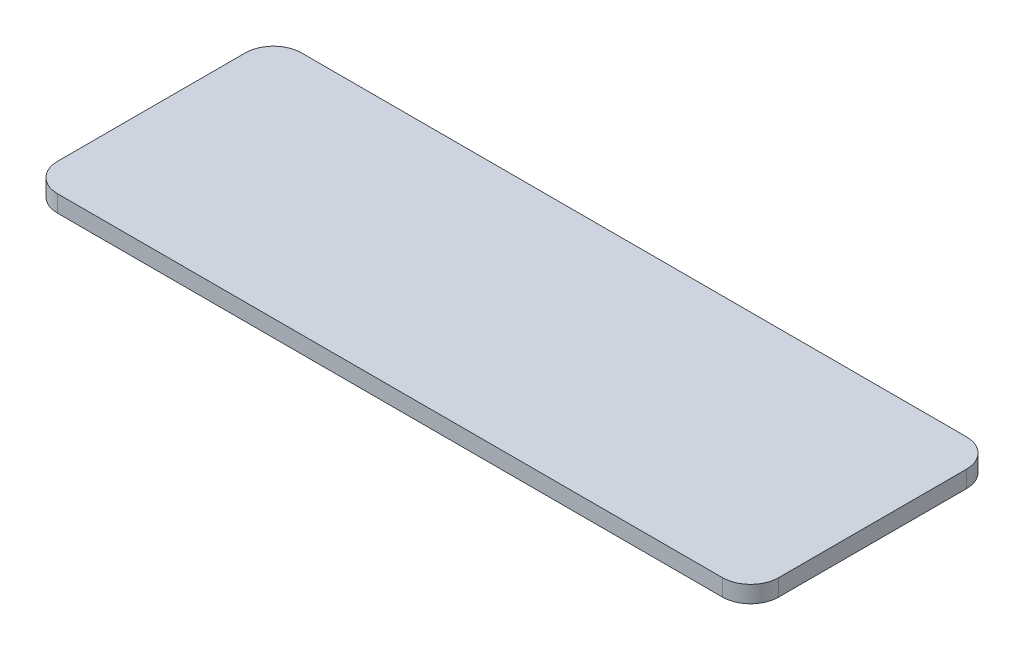
ISO-10303-21;
HEADER;
FILE_DESCRIPTION(('STEP AP214'),'2;1');
FILE_NAME('part.step','',(''),(''),'','','');
FILE_SCHEMA(('AUTOMOTIVE_DESIGN { 1 0 10303 214 1 1 1 1 }'));
ENDSEC;
DATA;
#1=APPLICATION_CONTEXT('core data for automotive mechanical design processes');
#2=APPLICATION_PROTOCOL_DEFINITION('international standard','automotive_design',2000,#1);
#3=PRODUCT_CONTEXT('',#1,'mechanical');
#4=PRODUCT('Part','Part','',(#3));
#5=PRODUCT_RELATED_PRODUCT_CATEGORY('part','',(#4));
#6=PRODUCT_DEFINITION_FORMATION('','',#4);
#7=PRODUCT_DEFINITION_CONTEXT('part definition',#1,'design');
#8=PRODUCT_DEFINITION('design','',#6,#7);
#9=PRODUCT_DEFINITION_SHAPE('','',#8);
#10=(LENGTH_UNIT() NAMED_UNIT(*) SI_UNIT(.MILLI.,.METRE.));
#11=(NAMED_UNIT(*) PLANE_ANGLE_UNIT() SI_UNIT($,.RADIAN.));
#12=(NAMED_UNIT(*) SI_UNIT($,.STERADIAN.) SOLID_ANGLE_UNIT());
#13=UNCERTAINTY_MEASURE_WITH_UNIT(LENGTH_MEASURE(1.E-05),#10,'distance_accuracy_value','');
#14=(GEOMETRIC_REPRESENTATION_CONTEXT(3) GLOBAL_UNCERTAINTY_ASSIGNED_CONTEXT((#13)) GLOBAL_UNIT_ASSIGNED_CONTEXT((#10,
#11,#12)) REPRESENTATION_CONTEXT('',''));
#15=CARTESIAN_POINT('',(0.,0.,0.));
#16=DIRECTION('',(0.,0.,1.));
#17=DIRECTION('',(1.,0.,0.));
#18=AXIS2_PLACEMENT_3D('',#15,#16,#17);
#19=CARTESIAN_POINT('',(35.2483988192163,6.,-35.0361602378579));
#20=DIRECTION('',(-1.,0.,0.));
#21=DIRECTION('',(0.,0.,1.));
#22=AXIS2_PLACEMENT_3D('',#19,#20,#21);
#23=PLANE('',#22);
#24=DIRECTION('',(0.,0.,-1.));
#25=VECTOR('',#24,1.);
#26=CARTESIAN_POINT('',(35.2483988192163,0.,-35.0361602378579));
#27=LINE('',#26,#25);
#28=CARTESIAN_POINT('',(35.2483988192163,0.,-45.0361602378579));
#29=VERTEX_POINT('',#28);
#30=CARTESIAN_POINT('',(35.2483988192163,0.,-111.80001656245));
#31=VERTEX_POINT('',#30);
#32=EDGE_CURVE('E128',#29,#31,#27,.T.);
#33=ORIENTED_EDGE('',*,*,#32,.T.);
#34=DIRECTION('',(0.,-1.,0.));
#35=VECTOR('',#34,1.);
#36=CARTESIAN_POINT('',(35.2483988192163,6.,-111.80001656245));
#37=LINE('',#36,#35);
#38=CARTESIAN_POINT('',(35.2483988192163,6.,-111.80001656245));
#39=VERTEX_POINT('',#38);
#40=EDGE_CURVE('E151',#31,#39,#37,.F.);
#41=ORIENTED_EDGE('',*,*,#40,.T.);
#42=DIRECTION('',(0.,0.,-1.));
#43=VECTOR('',#42,1.);
#44=CARTESIAN_POINT('',(35.2483988192163,6.,-35.0361602378579));
#45=LINE('',#44,#43);
#46=CARTESIAN_POINT('',(35.2483988192163,6.,-45.0361602378579));
#47=VERTEX_POINT('',#46);
#48=EDGE_CURVE('E126',#47,#39,#45,.T.);
#49=ORIENTED_EDGE('',*,*,#48,.F.);
#50=DIRECTION('',(0.,-1.,0.));
#51=VECTOR('',#50,1.);
#52=CARTESIAN_POINT('',(35.2483988192163,6.,-45.0361602378579));
#53=LINE('',#52,#51);
#54=EDGE_CURVE('E148',#47,#29,#53,.T.);
#55=ORIENTED_EDGE('',*,*,#54,.T.);
#56=EDGE_LOOP('',(#33,#41,#49,#55));
#57=FACE_BOUND('',#56,.T.);
#58=ADVANCED_FACE('F33',(#57),#23,.F.);
#59=CARTESIAN_POINT('',(-221.199113930992,6.,-121.80001656245));
#60=DIRECTION('',(0.,0.,1.));
#61=DIRECTION('',(1.,0.,0.));
#62=AXIS2_PLACEMENT_3D('',#59,#60,#61);
#63=PLANE('',#62);
#64=DIRECTION('',(-1.,0.,0.));
#65=VECTOR('',#64,1.);
#66=CARTESIAN_POINT('',(-221.199113930992,0.,-121.80001656245));
#67=LINE('',#66,#65);
#68=CARTESIAN_POINT('',(25.2483988192163,0.,-121.80001656245));
#69=VERTEX_POINT('',#68);
#70=CARTESIAN_POINT('',(-211.199113930992,0.,-121.80001656245));
#71=VERTEX_POINT('',#70);
#72=EDGE_CURVE('E124',#69,#71,#67,.T.);
#73=ORIENTED_EDGE('',*,*,#72,.T.);
#74=DIRECTION('',(0.,-1.,0.));
#75=VECTOR('',#74,1.);
#76=CARTESIAN_POINT('',(-211.199113930992,6.,-121.80001656245));
#77=LINE('',#76,#75);
#78=CARTESIAN_POINT('',(-211.199113930992,6.,-121.80001656245));
#79=VERTEX_POINT('',#78);
#80=EDGE_CURVE('E103',#71,#79,#77,.F.);
#81=ORIENTED_EDGE('',*,*,#80,.T.);
#82=DIRECTION('',(-1.,0.,0.));
#83=VECTOR('',#82,1.);
#84=CARTESIAN_POINT('',(-221.199113930992,6.,-121.80001656245));
#85=LINE('',#84,#83);
#86=CARTESIAN_POINT('',(25.2483988192163,6.,-121.80001656245));
#87=VERTEX_POINT('',#86);
#88=EDGE_CURVE('E167',#87,#79,#85,.T.);
#89=ORIENTED_EDGE('',*,*,#88,.F.);
#90=DIRECTION('',(0.,-1.,0.));
#91=VECTOR('',#90,1.);
#92=CARTESIAN_POINT('',(25.2483988192163,6.,-121.80001656245));
#93=LINE('',#92,#91);
#94=EDGE_CURVE('E108',#87,#69,#93,.T.);
#95=ORIENTED_EDGE('',*,*,#94,.T.);
#96=EDGE_LOOP('',(#73,#81,#89,#95));
#97=FACE_BOUND('',#96,.T.);
#98=ADVANCED_FACE('F184',(#97),#63,.F.);
#99=CARTESIAN_POINT('',(-221.199113930992,6.,-35.0361602378579));
#100=DIRECTION('',(1.,0.,0.));
#101=DIRECTION('',(0.,0.,-1.));
#102=AXIS2_PLACEMENT_3D('',#99,#100,#101);
#103=PLANE('',#102);
#104=DIRECTION('',(0.,0.,1.));
#105=VECTOR('',#104,1.);
#106=CARTESIAN_POINT('',(-221.199113930992,6.,-35.0361602378579));
#107=LINE('',#106,#105);
#108=CARTESIAN_POINT('',(-221.199113930992,6.,-111.80001656245));
#109=VERTEX_POINT('',#108);
#110=CARTESIAN_POINT('',(-221.199113930992,6.,-45.0361602378579));
#111=VERTEX_POINT('',#110);
#112=EDGE_CURVE('E117',#109,#111,#107,.T.);
#113=ORIENTED_EDGE('',*,*,#112,.F.);
#114=DIRECTION('',(0.,-1.,0.));
#115=VECTOR('',#114,1.);
#116=CARTESIAN_POINT('',(-221.199113930992,6.,-111.80001656245));
#117=LINE('',#116,#115);
#118=CARTESIAN_POINT('',(-221.199113930992,0.,-111.80001656245));
#119=VERTEX_POINT('',#118);
#120=EDGE_CURVE('E102',#109,#119,#117,.T.);
#121=ORIENTED_EDGE('',*,*,#120,.T.);
#122=DIRECTION('',(0.,0.,1.));
#123=VECTOR('',#122,1.);
#124=CARTESIAN_POINT('',(-221.199113930992,0.,-35.0361602378579));
#125=LINE('',#124,#123);
#126=CARTESIAN_POINT('',(-221.199113930992,0.,-45.0361602378579));
#127=VERTEX_POINT('',#126);
#128=EDGE_CURVE('E115',#119,#127,#125,.T.);
#129=ORIENTED_EDGE('',*,*,#128,.T.);
#130=DIRECTION('',(0.,-1.,0.));
#131=VECTOR('',#130,1.);
#132=CARTESIAN_POINT('',(-221.199113930992,6.,-45.0361602378579));
#133=LINE('',#132,#131);
#134=EDGE_CURVE('E119',#127,#111,#133,.F.);
#135=ORIENTED_EDGE('',*,*,#134,.T.);
#136=EDGE_LOOP('',(#113,#121,#129,#135));
#137=FACE_BOUND('',#136,.T.);
#138=ADVANCED_FACE('F114',(#137),#103,.F.);
#139=CARTESIAN_POINT('',(-221.199113930992,6.,-35.0361602378579));
#140=DIRECTION('',(0.,0.,-1.));
#141=DIRECTION('',(-1.,0.,0.));
#142=AXIS2_PLACEMENT_3D('',#139,#140,#141);
#143=PLANE('',#142);
#144=DIRECTION('',(1.,0.,0.));
#145=VECTOR('',#144,1.);
#146=CARTESIAN_POINT('',(-221.199113930992,0.,-35.0361602378579));
#147=LINE('',#146,#145);
#148=CARTESIAN_POINT('',(-211.199113930992,0.,-35.0361602378579));
#149=VERTEX_POINT('',#148);
#150=CARTESIAN_POINT('',(25.2483988192163,0.,-35.0361602378579));
#151=VERTEX_POINT('',#150);
#152=EDGE_CURVE('E123',#149,#151,#147,.T.);
#153=ORIENTED_EDGE('',*,*,#152,.T.);
#154=DIRECTION('',(0.,-1.,0.));
#155=VECTOR('',#154,1.);
#156=CARTESIAN_POINT('',(25.2483988192163,6.,-35.0361602378579));
#157=LINE('',#156,#155);
#158=CARTESIAN_POINT('',(25.2483988192163,6.,-35.0361602378579));
#159=VERTEX_POINT('',#158);
#160=EDGE_CURVE('E11',#151,#159,#157,.F.);
#161=ORIENTED_EDGE('',*,*,#160,.T.);
#162=DIRECTION('',(1.,0.,0.));
#163=VECTOR('',#162,1.);
#164=CARTESIAN_POINT('',(-221.199113930992,6.,-35.0361602378579));
#165=LINE('',#164,#163);
#166=CARTESIAN_POINT('',(-211.199113930992,6.,-35.0361602378579));
#167=VERTEX_POINT('',#166);
#168=EDGE_CURVE('E132',#167,#159,#165,.T.);
#169=ORIENTED_EDGE('',*,*,#168,.F.);
#170=DIRECTION('',(0.,-1.,0.));
#171=VECTOR('',#170,1.);
#172=CARTESIAN_POINT('',(-211.199113930992,6.,-35.0361602378579));
#173=LINE('',#172,#171);
#174=EDGE_CURVE('E41',#167,#149,#173,.T.);
#175=ORIENTED_EDGE('',*,*,#174,.T.);
#176=EDGE_LOOP('',(#153,#161,#169,#175));
#177=FACE_BOUND('',#176,.T.);
#178=ADVANCED_FACE('F154',(#177),#143,.F.);
#179=CARTESIAN_POINT('',(0.,6.,0.));
#180=DIRECTION('',(0.,-1.,0.));
#181=DIRECTION('',(0.,0.,-1.));
#182=AXIS2_PLACEMENT_3D('',#179,#180,#181);
#183=PLANE('',#182);
#184=ORIENTED_EDGE('',*,*,#88,.T.);
#185=CARTESIAN_POINT('',(-211.199113930992,6.,-111.80001656245));
#186=DIRECTION('',(0.,-1.,0.));
#187=DIRECTION('',(0.,0.,-1.));
#188=AXIS2_PLACEMENT_3D('',#185,#186,#187);
#189=CIRCLE('',#188,10.);
#190=EDGE_CURVE('E146',#79,#109,#189,.F.);
#191=ORIENTED_EDGE('',*,*,#190,.T.);
#192=ORIENTED_EDGE('',*,*,#112,.T.);
#193=CARTESIAN_POINT('',(-211.199113930992,6.,-45.0361602378579));
#194=DIRECTION('',(0.,-1.,0.));
#195=DIRECTION('',(0.,0.,-1.));
#196=AXIS2_PLACEMENT_3D('',#193,#194,#195);
#197=CIRCLE('',#196,10.);
#198=EDGE_CURVE('E53',#111,#167,#197,.F.);
#199=ORIENTED_EDGE('',*,*,#198,.T.);
#200=ORIENTED_EDGE('',*,*,#168,.T.);
#201=CARTESIAN_POINT('',(25.2483988192163,6.,-45.0361602378579));
#202=DIRECTION('',(0.,-1.,0.));
#203=DIRECTION('',(0.,0.,-1.));
#204=AXIS2_PLACEMENT_3D('',#201,#202,#203);
#205=CIRCLE('',#204,10.);
#206=EDGE_CURVE('E142',#159,#47,#205,.F.);
#207=ORIENTED_EDGE('',*,*,#206,.T.);
#208=ORIENTED_EDGE('',*,*,#48,.T.);
#209=CARTESIAN_POINT('',(25.2483988192163,6.,-111.80001656245));
#210=DIRECTION('',(0.,-1.,0.));
#211=DIRECTION('',(0.,0.,-1.));
#212=AXIS2_PLACEMENT_3D('',#209,#210,#211);
#213=CIRCLE('',#212,10.);
#214=EDGE_CURVE('E144',#39,#87,#213,.F.);
#215=ORIENTED_EDGE('',*,*,#214,.T.);
#216=EDGE_LOOP('',(#184,#191,#192,#199,#200,#207,#208,#215));
#217=FACE_BOUND('',#216,.T.);
#218=ADVANCED_FACE('F173',(#217),#183,.F.);
#219=CARTESIAN_POINT('',(0.,0.,0.));
#220=DIRECTION('',(0.,-1.,0.));
#221=DIRECTION('',(0.,0.,-1.));
#222=AXIS2_PLACEMENT_3D('',#219,#220,#221);
#223=PLANE('',#222);
#224=ORIENTED_EDGE('',*,*,#128,.F.);
#225=CARTESIAN_POINT('',(-211.199113930992,0.,-111.80001656245));
#226=DIRECTION('',(0.,-1.,0.));
#227=DIRECTION('',(0.,0.,-1.));
#228=AXIS2_PLACEMENT_3D('',#225,#226,#227);
#229=CIRCLE('',#228,10.);
#230=EDGE_CURVE('E98',#119,#71,#229,.T.);
#231=ORIENTED_EDGE('',*,*,#230,.T.);
#232=ORIENTED_EDGE('',*,*,#72,.F.);
#233=CARTESIAN_POINT('',(25.2483988192163,0.,-111.80001656245));
#234=DIRECTION('',(0.,-1.,0.));
#235=DIRECTION('',(0.,0.,-1.));
#236=AXIS2_PLACEMENT_3D('',#233,#234,#235);
#237=CIRCLE('',#236,10.);
#238=EDGE_CURVE('E109',#69,#31,#237,.T.);
#239=ORIENTED_EDGE('',*,*,#238,.T.);
#240=ORIENTED_EDGE('',*,*,#32,.F.);
#241=CARTESIAN_POINT('',(25.2483988192163,0.,-45.0361602378579));
#242=DIRECTION('',(0.,-1.,0.));
#243=DIRECTION('',(0.,0.,-1.));
#244=AXIS2_PLACEMENT_3D('',#241,#242,#243);
#245=CIRCLE('',#244,10.);
#246=EDGE_CURVE('E135',#29,#151,#245,.T.);
#247=ORIENTED_EDGE('',*,*,#246,.T.);
#248=ORIENTED_EDGE('',*,*,#152,.F.);
#249=CARTESIAN_POINT('',(-211.199113930992,0.,-45.0361602378579));
#250=DIRECTION('',(0.,-1.,0.));
#251=DIRECTION('',(0.,0.,-1.));
#252=AXIS2_PLACEMENT_3D('',#249,#250,#251);
#253=CIRCLE('',#252,10.);
#254=EDGE_CURVE('E118',#149,#127,#253,.T.);
#255=ORIENTED_EDGE('',*,*,#254,.T.);
#256=EDGE_LOOP('',(#224,#231,#232,#239,#240,#247,#248,#255));
#257=FACE_BOUND('',#256,.T.);
#258=ADVANCED_FACE('F121',(#257),#223,.T.);
#259=CARTESIAN_POINT('',(-211.199113930992,6.,-111.80001656245));
#260=DIRECTION('',(0.,-1.,0.));
#261=DIRECTION('',(0.,0.,-1.));
#262=AXIS2_PLACEMENT_3D('',#259,#260,#261);
#263=CYLINDRICAL_SURFACE('',#262,10.);
#264=ORIENTED_EDGE('',*,*,#190,.F.);
#265=ORIENTED_EDGE('',*,*,#80,.F.);
#266=ORIENTED_EDGE('',*,*,#230,.F.);
#267=ORIENTED_EDGE('',*,*,#120,.F.);
#268=EDGE_LOOP('',(#264,#265,#266,#267));
#269=FACE_BOUND('',#268,.T.);
#270=ADVANCED_FACE('F101',(#269),#263,.T.);
#271=CARTESIAN_POINT('',(25.2483988192163,6.,-111.80001656245));
#272=DIRECTION('',(0.,-1.,0.));
#273=DIRECTION('',(0.,0.,-1.));
#274=AXIS2_PLACEMENT_3D('',#271,#272,#273);
#275=CYLINDRICAL_SURFACE('',#274,10.);
#276=ORIENTED_EDGE('',*,*,#214,.F.);
#277=ORIENTED_EDGE('',*,*,#40,.F.);
#278=ORIENTED_EDGE('',*,*,#238,.F.);
#279=ORIENTED_EDGE('',*,*,#94,.F.);
#280=EDGE_LOOP('',(#276,#277,#278,#279));
#281=FACE_BOUND('',#280,.T.);
#282=ADVANCED_FACE('F195',(#281),#275,.T.);
#283=CARTESIAN_POINT('',(25.2483988192163,6.,-45.0361602378579));
#284=DIRECTION('',(0.,-1.,0.));
#285=DIRECTION('',(0.,0.,-1.));
#286=AXIS2_PLACEMENT_3D('',#283,#284,#285);
#287=CYLINDRICAL_SURFACE('',#286,10.);
#288=ORIENTED_EDGE('',*,*,#206,.F.);
#289=ORIENTED_EDGE('',*,*,#160,.F.);
#290=ORIENTED_EDGE('',*,*,#246,.F.);
#291=ORIENTED_EDGE('',*,*,#54,.F.);
#292=EDGE_LOOP('',(#288,#289,#290,#291));
#293=FACE_BOUND('',#292,.T.);
#294=ADVANCED_FACE('F161',(#293),#287,.T.);
#295=CARTESIAN_POINT('',(-211.199113930992,6.,-45.0361602378579));
#296=DIRECTION('',(0.,-1.,0.));
#297=DIRECTION('',(0.,0.,-1.));
#298=AXIS2_PLACEMENT_3D('',#295,#296,#297);
#299=CYLINDRICAL_SURFACE('',#298,10.);
#300=ORIENTED_EDGE('',*,*,#198,.F.);
#301=ORIENTED_EDGE('',*,*,#134,.F.);
#302=ORIENTED_EDGE('',*,*,#254,.F.);
#303=ORIENTED_EDGE('',*,*,#174,.F.);
#304=EDGE_LOOP('',(#300,#301,#302,#303));
#305=FACE_BOUND('',#304,.T.);
#306=ADVANCED_FACE('F35',(#305),#299,.T.);
#307=CLOSED_SHELL('',(#58,#98,#138,#178,#218,#258,#270,#282,#294,#306));
#308=MANIFOLD_SOLID_BREP('B2',#307);
#309=ADVANCED_BREP_SHAPE_REPRESENTATION('',(#18,#308),#14);
#310=SHAPE_DEFINITION_REPRESENTATION(#9,#309);
ENDSEC;
END-ISO-10303-21;
